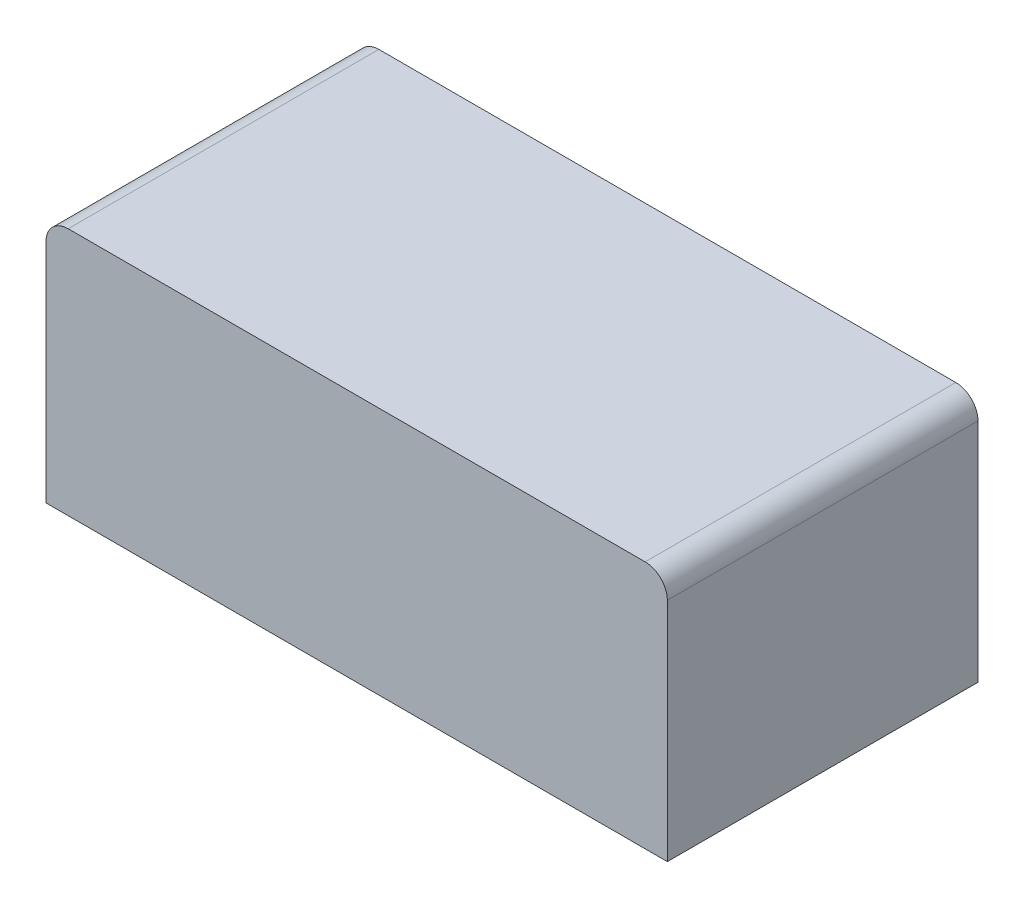
ISO-10303-21;
HEADER;
FILE_DESCRIPTION(('STEP AP214'),'2;1');
FILE_NAME('part.step','',(''),(''),'','','');
FILE_SCHEMA(('AUTOMOTIVE_DESIGN { 1 0 10303 214 1 1 1 1 }'));
ENDSEC;
DATA;
#1=APPLICATION_CONTEXT('core data for automotive mechanical design processes');
#2=APPLICATION_PROTOCOL_DEFINITION('international standard','automotive_design',2000,#1);
#3=PRODUCT_CONTEXT('',#1,'mechanical');
#4=PRODUCT('Part','Part','',(#3));
#5=PRODUCT_RELATED_PRODUCT_CATEGORY('part','',(#4));
#6=PRODUCT_DEFINITION_FORMATION('','',#4);
#7=PRODUCT_DEFINITION_CONTEXT('part definition',#1,'design');
#8=PRODUCT_DEFINITION('design','',#6,#7);
#9=PRODUCT_DEFINITION_SHAPE('','',#8);
#10=(LENGTH_UNIT() NAMED_UNIT(*) SI_UNIT(.MILLI.,.METRE.));
#11=(NAMED_UNIT(*) PLANE_ANGLE_UNIT() SI_UNIT($,.RADIAN.));
#12=(NAMED_UNIT(*) SI_UNIT($,.STERADIAN.) SOLID_ANGLE_UNIT());
#13=UNCERTAINTY_MEASURE_WITH_UNIT(LENGTH_MEASURE(1.E-05),#10,'distance_accuracy_value','');
#14=(GEOMETRIC_REPRESENTATION_CONTEXT(3) GLOBAL_UNCERTAINTY_ASSIGNED_CONTEXT((#13)) GLOBAL_UNIT_ASSIGNED_CONTEXT((#10,
#11,#12)) REPRESENTATION_CONTEXT('',''));
#15=CARTESIAN_POINT('',(0.,0.,0.));
#16=DIRECTION('',(0.,0.,1.));
#17=DIRECTION('',(1.,0.,0.));
#18=AXIS2_PLACEMENT_3D('',#15,#16,#17);
#19=CARTESIAN_POINT('',(-1.30000000000001,1.02,0.699999999999999));
#20=DIRECTION('',(0.,0.,1.));
#21=DIRECTION('',(1.,0.,0.));
#22=AXIS2_PLACEMENT_3D('',#19,#20,#21);
#23=CYLINDRICAL_SURFACE('',#22,0.1);
#24=CARTESIAN_POINT('',(-1.30000000000001,1.02,0.699999999999999));
#25=DIRECTION('',(0.,0.,1.));
#26=DIRECTION('',(1.,0.,0.));
#27=AXIS2_PLACEMENT_3D('',#24,#25,#26);
#28=CIRCLE('',#27,0.1);
#29=CARTESIAN_POINT('',(-1.40000000000001,1.02,0.699999999999999));
#30=VERTEX_POINT('',#29);
#31=CARTESIAN_POINT('',(-1.30000000000001,1.12,0.699999999999999));
#32=VERTEX_POINT('',#31);
#33=EDGE_CURVE('E99',#30,#32,#28,.F.);
#34=ORIENTED_EDGE('',*,*,#33,.T.);
#35=DIRECTION('',(0.,0.,-1.));
#36=VECTOR('',#35,1.);
#37=CARTESIAN_POINT('',(-1.30000000000001,1.12,0.699999999999999));
#38=LINE('',#37,#36);
#39=CARTESIAN_POINT('',(-1.30000000000001,1.12,-0.699999999999999));
#40=VERTEX_POINT('',#39);
#41=EDGE_CURVE('E74',#32,#40,#38,.T.);
#42=ORIENTED_EDGE('',*,*,#41,.T.);
#43=CARTESIAN_POINT('',(-1.30000000000001,1.02,-0.699999999999999));
#44=DIRECTION('',(0.,0.,1.));
#45=DIRECTION('',(1.,0.,0.));
#46=AXIS2_PLACEMENT_3D('',#43,#44,#45);
#47=CIRCLE('',#46,0.1);
#48=CARTESIAN_POINT('',(-1.40000000000001,1.02,-0.699999999999999));
#49=VERTEX_POINT('',#48);
#50=EDGE_CURVE('E20',#40,#49,#47,.T.);
#51=ORIENTED_EDGE('',*,*,#50,.T.);
#52=DIRECTION('',(0.,0.,-1.));
#53=VECTOR('',#52,1.);
#54=CARTESIAN_POINT('',(-1.40000000000001,1.02,0.699999999999999));
#55=LINE('',#54,#53);
#56=EDGE_CURVE('E71',#49,#30,#55,.F.);
#57=ORIENTED_EDGE('',*,*,#56,.T.);
#58=EDGE_LOOP('',(#34,#42,#51,#57));
#59=FACE_BOUND('',#58,.T.);
#60=ADVANCED_FACE('F17',(#59),#23,.T.);
#61=CARTESIAN_POINT('',(-1.40000000000001,1.12,0.699999999999999));
#62=DIRECTION('',(0.,-1.,0.));
#63=DIRECTION('',(0.,0.,-1.));
#64=AXIS2_PLACEMENT_3D('',#61,#62,#63);
#65=PLANE('',#64);
#66=DIRECTION('',(0.,0.,-1.));
#67=VECTOR('',#66,1.);
#68=CARTESIAN_POINT('',(1.29999999999999,1.12,0.7));
#69=LINE('',#68,#67);
#70=CARTESIAN_POINT('',(1.29999999999999,1.12,-0.699999999999992));
#71=VERTEX_POINT('',#70);
#72=CARTESIAN_POINT('',(1.29999999999999,1.12,0.699999999999993));
#73=VERTEX_POINT('',#72);
#74=EDGE_CURVE('E122',#71,#73,#69,.F.);
#75=ORIENTED_EDGE('',*,*,#74,.F.);
#76=DIRECTION('',(1.,0.,0.));
#77=VECTOR('',#76,1.);
#78=CARTESIAN_POINT('',(1.39999999999999,1.12,-0.699999999999992));
#79=LINE('',#78,#77);
#80=EDGE_CURVE('E90',#71,#40,#79,.F.);
#81=ORIENTED_EDGE('',*,*,#80,.T.);
#82=ORIENTED_EDGE('',*,*,#41,.F.);
#83=DIRECTION('',(-1.,0.,0.));
#84=VECTOR('',#83,1.);
#85=CARTESIAN_POINT('',(1.39999999999999,1.12,0.699999999999992));
#86=LINE('',#85,#84);
#87=EDGE_CURVE('E97',#32,#73,#86,.F.);
#88=ORIENTED_EDGE('',*,*,#87,.T.);
#89=EDGE_LOOP('',(#75,#81,#82,#88));
#90=FACE_BOUND('',#89,.T.);
#91=ADVANCED_FACE('F133',(#90),#65,.F.);
#92=CARTESIAN_POINT('',(1.29999999999999,1.02,0.7));
#93=DIRECTION('',(0.,0.,-1.));
#94=DIRECTION('',(-1.,0.,0.));
#95=AXIS2_PLACEMENT_3D('',#92,#93,#94);
#96=CYLINDRICAL_SURFACE('',#95,0.1);
#97=CARTESIAN_POINT('',(1.29999999999999,1.02,-0.699999999999992));
#98=DIRECTION('',(0.,0.,-1.));
#99=DIRECTION('',(-1.,0.,0.));
#100=AXIS2_PLACEMENT_3D('',#97,#98,#99);
#101=CIRCLE('',#100,0.1);
#102=CARTESIAN_POINT('',(1.39999999999999,1.02,-0.699999999999992));
#103=VERTEX_POINT('',#102);
#104=EDGE_CURVE('E87',#103,#71,#101,.F.);
#105=ORIENTED_EDGE('',*,*,#104,.T.);
#106=ORIENTED_EDGE('',*,*,#74,.T.);
#107=CARTESIAN_POINT('',(1.29999999999999,1.02,0.699999999999993));
#108=DIRECTION('',(0.,0.,-1.));
#109=DIRECTION('',(-1.,0.,0.));
#110=AXIS2_PLACEMENT_3D('',#107,#108,#109);
#111=CIRCLE('',#110,0.1);
#112=CARTESIAN_POINT('',(1.39999999999999,1.02,0.699999999999993));
#113=VERTEX_POINT('',#112);
#114=EDGE_CURVE('E82',#73,#113,#111,.T.);
#115=ORIENTED_EDGE('',*,*,#114,.T.);
#116=DIRECTION('',(0.,0.,1.));
#117=VECTOR('',#116,1.);
#118=CARTESIAN_POINT('',(1.39999999999999,1.02,0.699999999999992));
#119=LINE('',#118,#117);
#120=EDGE_CURVE('E100',#113,#103,#119,.F.);
#121=ORIENTED_EDGE('',*,*,#120,.T.);
#122=EDGE_LOOP('',(#105,#106,#115,#121));
#123=FACE_BOUND('',#122,.T.);
#124=ADVANCED_FACE('F139',(#123),#96,.T.);
#125=CARTESIAN_POINT('',(1.39999999999999,1.12,0.699999999999992));
#126=DIRECTION('',(0.,0.,-1.));
#127=DIRECTION('',(-1.,0.,0.));
#128=AXIS2_PLACEMENT_3D('',#125,#126,#127);
#129=PLANE('',#128);
#130=ORIENTED_EDGE('',*,*,#114,.F.);
#131=ORIENTED_EDGE('',*,*,#87,.F.);
#132=ORIENTED_EDGE('',*,*,#33,.F.);
#133=DIRECTION('',(0.,1.,0.));
#134=VECTOR('',#133,1.);
#135=CARTESIAN_POINT('',(-1.40000000000001,1.12,0.699999999999999));
#136=LINE('',#135,#134);
#137=CARTESIAN_POINT('',(-1.40000000000001,0.,0.699999999999996));
#138=VERTEX_POINT('',#137);
#139=EDGE_CURVE('E81',#30,#138,#136,.F.);
#140=ORIENTED_EDGE('',*,*,#139,.T.);
#141=DIRECTION('',(1.,0.,0.));
#142=VECTOR('',#141,1.);
#143=CARTESIAN_POINT('',(-1.40000000000001,0.,0.699999999999992));
#144=LINE('',#143,#142);
#145=CARTESIAN_POINT('',(1.39999999999999,0.,0.699999999999992));
#146=VERTEX_POINT('',#145);
#147=EDGE_CURVE('E104',#146,#138,#144,.F.);
#148=ORIENTED_EDGE('',*,*,#147,.F.);
#149=DIRECTION('',(0.,1.,0.));
#150=VECTOR('',#149,1.);
#151=CARTESIAN_POINT('',(1.39999999999999,1.12,0.699999999999992));
#152=LINE('',#151,#150);
#153=EDGE_CURVE('E102',#146,#113,#152,.T.);
#154=ORIENTED_EDGE('',*,*,#153,.T.);
#155=EDGE_LOOP('',(#130,#131,#132,#140,#148,#154));
#156=FACE_BOUND('',#155,.T.);
#157=ADVANCED_FACE('F135',(#156),#129,.F.);
#158=CARTESIAN_POINT('',(-1.40000000000001,1.12,0.699999999999999));
#159=DIRECTION('',(1.,0.,0.));
#160=DIRECTION('',(0.,0.,-1.));
#161=AXIS2_PLACEMENT_3D('',#158,#159,#160);
#162=PLANE('',#161);
#163=ORIENTED_EDGE('',*,*,#56,.F.);
#164=DIRECTION('',(0.,1.,0.));
#165=VECTOR('',#164,1.);
#166=CARTESIAN_POINT('',(-1.40000000000001,1.12,-0.699999999999999));
#167=LINE('',#166,#165);
#168=CARTESIAN_POINT('',(-1.40000000000001,0.,-0.699999999999999));
#169=VERTEX_POINT('',#168);
#170=EDGE_CURVE('E80',#49,#169,#167,.F.);
#171=ORIENTED_EDGE('',*,*,#170,.T.);
#172=DIRECTION('',(0.,0.,-1.));
#173=VECTOR('',#172,1.);
#174=CARTESIAN_POINT('',(-1.40000000000001,0.,0.699999999999999));
#175=LINE('',#174,#173);
#176=EDGE_CURVE('E110',#138,#169,#175,.T.);
#177=ORIENTED_EDGE('',*,*,#176,.F.);
#178=ORIENTED_EDGE('',*,*,#139,.F.);
#179=EDGE_LOOP('',(#163,#171,#177,#178));
#180=FACE_BOUND('',#179,.T.);
#181=ADVANCED_FACE('F78',(#180),#162,.F.);
#182=CARTESIAN_POINT('',(1.39999999999999,1.12,-0.699999999999992));
#183=DIRECTION('',(0.,0.,1.));
#184=DIRECTION('',(1.,0.,0.));
#185=AXIS2_PLACEMENT_3D('',#182,#183,#184);
#186=PLANE('',#185);
#187=ORIENTED_EDGE('',*,*,#104,.F.);
#188=DIRECTION('',(0.,1.,0.));
#189=VECTOR('',#188,1.);
#190=CARTESIAN_POINT('',(1.39999999999999,1.12,-0.699999999999992));
#191=LINE('',#190,#189);
#192=CARTESIAN_POINT('',(1.39999999999999,0.,-0.699999999999992));
#193=VERTEX_POINT('',#192);
#194=EDGE_CURVE('E35',#103,#193,#191,.F.);
#195=ORIENTED_EDGE('',*,*,#194,.T.);
#196=DIRECTION('',(1.,0.,0.));
#197=VECTOR('',#196,1.);
#198=CARTESIAN_POINT('',(-1.40000000000001,0.,-0.699999999999999));
#199=LINE('',#198,#197);
#200=EDGE_CURVE('E26',#169,#193,#199,.T.);
#201=ORIENTED_EDGE('',*,*,#200,.F.);
#202=ORIENTED_EDGE('',*,*,#170,.F.);
#203=ORIENTED_EDGE('',*,*,#50,.F.);
#204=ORIENTED_EDGE('',*,*,#80,.F.);
#205=EDGE_LOOP('',(#187,#195,#201,#202,#203,#204));
#206=FACE_BOUND('',#205,.T.);
#207=ADVANCED_FACE('F84',(#206),#186,.F.);
#208=CARTESIAN_POINT('',(1.39999999999999,1.12,0.699999999999992));
#209=DIRECTION('',(-1.,0.,0.));
#210=DIRECTION('',(0.,0.,1.));
#211=AXIS2_PLACEMENT_3D('',#208,#209,#210);
#212=PLANE('',#211);
#213=ORIENTED_EDGE('',*,*,#120,.F.);
#214=ORIENTED_EDGE('',*,*,#153,.F.);
#215=DIRECTION('',(0.,0.,-1.));
#216=VECTOR('',#215,1.);
#217=CARTESIAN_POINT('',(1.39999999999999,0.,0.699999999999999));
#218=LINE('',#217,#216);
#219=EDGE_CURVE('E11',#193,#146,#218,.F.);
#220=ORIENTED_EDGE('',*,*,#219,.F.);
#221=ORIENTED_EDGE('',*,*,#194,.F.);
#222=EDGE_LOOP('',(#213,#214,#220,#221));
#223=FACE_BOUND('',#222,.T.);
#224=ADVANCED_FACE('F141',(#223),#212,.F.);
#225=CARTESIAN_POINT('',(-1.40000000000001,0.,0.699999999999999));
#226=DIRECTION('',(0.,-1.,0.));
#227=DIRECTION('',(0.,0.,-1.));
#228=AXIS2_PLACEMENT_3D('',#225,#226,#227);
#229=PLANE('',#228);
#230=ORIENTED_EDGE('',*,*,#200,.T.);
#231=ORIENTED_EDGE('',*,*,#219,.T.);
#232=ORIENTED_EDGE('',*,*,#147,.T.);
#233=ORIENTED_EDGE('',*,*,#176,.T.);
#234=EDGE_LOOP('',(#230,#231,#232,#233));
#235=FACE_BOUND('',#234,.T.);
#236=ADVANCED_FACE('F143',(#235),#229,.T.);
#237=CLOSED_SHELL('',(#60,#91,#124,#157,#181,#207,#224,#236));
#238=MANIFOLD_SOLID_BREP('B1',#237);
#239=ADVANCED_BREP_SHAPE_REPRESENTATION('',(#18,#238),#14);
#240=SHAPE_DEFINITION_REPRESENTATION(#9,#239);
ENDSEC;
END-ISO-10303-21;
